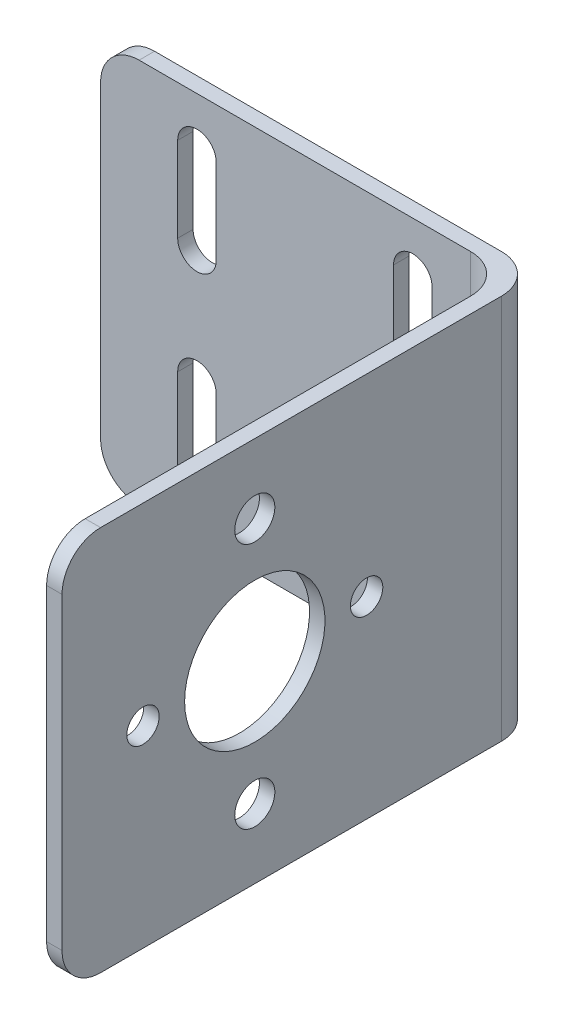
ISO-10303-21;
HEADER;
FILE_DESCRIPTION(('STEP AP214'),'2;1');
FILE_NAME('part.step','',(''),(''),'','','');
FILE_SCHEMA(('AUTOMOTIVE_DESIGN { 1 0 10303 214 1 1 1 1 }'));
ENDSEC;
DATA;
#1=APPLICATION_CONTEXT('core data for automotive mechanical design processes');
#2=APPLICATION_PROTOCOL_DEFINITION('international standard','automotive_design',2000,#1);
#3=PRODUCT_CONTEXT('',#1,'mechanical');
#4=PRODUCT('Part','Part','',(#3));
#5=PRODUCT_RELATED_PRODUCT_CATEGORY('part','',(#4));
#6=PRODUCT_DEFINITION_FORMATION('','',#4);
#7=PRODUCT_DEFINITION_CONTEXT('part definition',#1,'design');
#8=PRODUCT_DEFINITION('design','',#6,#7);
#9=PRODUCT_DEFINITION_SHAPE('','',#8);
#10=(LENGTH_UNIT() NAMED_UNIT(*) SI_UNIT(.MILLI.,.METRE.));
#11=(NAMED_UNIT(*) PLANE_ANGLE_UNIT() SI_UNIT($,.RADIAN.));
#12=(NAMED_UNIT(*) SI_UNIT($,.STERADIAN.) SOLID_ANGLE_UNIT());
#13=UNCERTAINTY_MEASURE_WITH_UNIT(LENGTH_MEASURE(1.E-05),#10,'distance_accuracy_value','');
#14=(GEOMETRIC_REPRESENTATION_CONTEXT(3) GLOBAL_UNCERTAINTY_ASSIGNED_CONTEXT((#13)) GLOBAL_UNIT_ASSIGNED_CONTEXT((#10,
#11,#12)) REPRESENTATION_CONTEXT('',''));
#15=CARTESIAN_POINT('',(0.,0.,0.));
#16=DIRECTION('',(0.,0.,1.));
#17=DIRECTION('',(1.,0.,0.));
#18=AXIS2_PLACEMENT_3D('',#15,#16,#17);
#19=CARTESIAN_POINT('',(-26.5,25.,2.));
#20=DIRECTION('',(0.,-1.,0.));
#21=DIRECTION('',(1.,0.,0.));
#22=AXIS2_PLACEMENT_3D('',#19,#20,#21);
#23=PLANE('',#22);
#24=DIRECTION('',(-1.,0.,0.));
#25=VECTOR('',#24,1.);
#26=CARTESIAN_POINT('',(-26.5,25.,0.));
#27=LINE('',#26,#25);
#28=CARTESIAN_POINT('',(23.5,25.,0.));
#29=VERTEX_POINT('',#28);
#30=CARTESIAN_POINT('',(-21.5,25.,0.));
#31=VERTEX_POINT('',#30);
#32=EDGE_CURVE('E391',#29,#31,#27,.T.);
#33=ORIENTED_EDGE('',*,*,#32,.T.);
#34=DIRECTION('',(0.,0.,-1.));
#35=VECTOR('',#34,1.);
#36=CARTESIAN_POINT('',(-21.5,25.,2.));
#37=LINE('',#36,#35);
#38=CARTESIAN_POINT('',(-21.5,25.,2.));
#39=VERTEX_POINT('',#38);
#40=EDGE_CURVE('E438',#31,#39,#37,.F.);
#41=ORIENTED_EDGE('',*,*,#40,.T.);
#42=DIRECTION('',(-1.,0.,0.));
#43=VECTOR('',#42,1.);
#44=CARTESIAN_POINT('',(-26.5,25.,2.));
#45=LINE('',#44,#43);
#46=CARTESIAN_POINT('',(21.5,25.,2.));
#47=VERTEX_POINT('',#46);
#48=EDGE_CURVE('E392',#47,#39,#45,.T.);
#49=ORIENTED_EDGE('',*,*,#48,.F.);
#50=CARTESIAN_POINT('',(21.5,25.,7.));
#51=DIRECTION('',(0.,-1.,0.));
#52=DIRECTION('',(1.,0.,0.));
#53=AXIS2_PLACEMENT_3D('',#50,#51,#52);
#54=CIRCLE('',#53,5.);
#55=CARTESIAN_POINT('',(26.5,25.,7.));
#56=VERTEX_POINT('',#55);
#57=EDGE_CURVE('E47',#47,#56,#54,.T.);
#58=ORIENTED_EDGE('',*,*,#57,.T.);
#59=DIRECTION('',(0.,0.,-1.));
#60=VECTOR('',#59,1.);
#61=CARTESIAN_POINT('',(26.5,25.,62.));
#62=LINE('',#61,#60);
#63=CARTESIAN_POINT('',(26.5,25.,57.));
#64=VERTEX_POINT('',#63);
#65=EDGE_CURVE('E382',#64,#56,#62,.T.);
#66=ORIENTED_EDGE('',*,*,#65,.F.);
#67=DIRECTION('',(-1.,0.,0.));
#68=VECTOR('',#67,1.);
#69=CARTESIAN_POINT('',(28.5,25.,57.));
#70=LINE('',#69,#68);
#71=CARTESIAN_POINT('',(28.5,25.,57.));
#72=VERTEX_POINT('',#71);
#73=EDGE_CURVE('E434',#64,#72,#70,.F.);
#74=ORIENTED_EDGE('',*,*,#73,.T.);
#75=DIRECTION('',(0.,0.,-1.));
#76=VECTOR('',#75,1.);
#77=CARTESIAN_POINT('',(28.5,25.,62.));
#78=LINE('',#77,#76);
#79=CARTESIAN_POINT('',(28.5,25.,5.));
#80=VERTEX_POINT('',#79);
#81=EDGE_CURVE('E385',#72,#80,#78,.T.);
#82=ORIENTED_EDGE('',*,*,#81,.T.);
#83=CARTESIAN_POINT('',(23.5,25.,5.));
#84=DIRECTION('',(0.,-1.,0.));
#85=DIRECTION('',(1.,0.,0.));
#86=AXIS2_PLACEMENT_3D('',#83,#84,#85);
#87=CIRCLE('',#86,5.);
#88=EDGE_CURVE('E436',#80,#29,#87,.F.);
#89=ORIENTED_EDGE('',*,*,#88,.T.);
#90=EDGE_LOOP('',(#33,#41,#49,#58,#66,#74,#82,#89));
#91=FACE_BOUND('',#90,.T.);
#92=ADVANCED_FACE('F39',(#91),#23,.F.);
#93=CARTESIAN_POINT('',(-26.5,-25.,2.));
#94=DIRECTION('',(1.,0.,0.));
#95=DIRECTION('',(0.,0.,-1.));
#96=AXIS2_PLACEMENT_3D('',#93,#94,#95);
#97=PLANE('',#96);
#98=DIRECTION('',(0.,-1.,0.));
#99=VECTOR('',#98,1.);
#100=CARTESIAN_POINT('',(-26.5,-25.,0.));
#101=LINE('',#100,#99);
#102=CARTESIAN_POINT('',(-26.5,20.,0.));
#103=VERTEX_POINT('',#102);
#104=CARTESIAN_POINT('',(-26.5,-20.,0.));
#105=VERTEX_POINT('',#104);
#106=EDGE_CURVE('E405',#103,#105,#101,.T.);
#107=ORIENTED_EDGE('',*,*,#106,.T.);
#108=DIRECTION('',(0.,0.,-1.));
#109=VECTOR('',#108,1.);
#110=CARTESIAN_POINT('',(-26.5,-20.,2.));
#111=LINE('',#110,#109);
#112=CARTESIAN_POINT('',(-26.5,-20.,2.));
#113=VERTEX_POINT('',#112);
#114=EDGE_CURVE('E425',#105,#113,#111,.F.);
#115=ORIENTED_EDGE('',*,*,#114,.T.);
#116=DIRECTION('',(0.,-1.,0.));
#117=VECTOR('',#116,1.);
#118=CARTESIAN_POINT('',(-26.5,-25.,2.));
#119=LINE('',#118,#117);
#120=CARTESIAN_POINT('',(-26.5,20.,2.));
#121=VERTEX_POINT('',#120);
#122=EDGE_CURVE('E395',#121,#113,#119,.T.);
#123=ORIENTED_EDGE('',*,*,#122,.F.);
#124=DIRECTION('',(0.,0.,-1.));
#125=VECTOR('',#124,1.);
#126=CARTESIAN_POINT('',(-26.5,20.,2.));
#127=LINE('',#126,#125);
#128=EDGE_CURVE('E422',#121,#103,#127,.T.);
#129=ORIENTED_EDGE('',*,*,#128,.T.);
#130=EDGE_LOOP('',(#107,#115,#123,#129));
#131=FACE_BOUND('',#130,.T.);
#132=ADVANCED_FACE('F500',(#131),#97,.F.);
#133=CARTESIAN_POINT('',(-26.5,-25.,2.));
#134=DIRECTION('',(0.,1.,0.));
#135=DIRECTION('',(-1.,0.,0.));
#136=AXIS2_PLACEMENT_3D('',#133,#134,#135);
#137=PLANE('',#136);
#138=DIRECTION('',(1.,0.,0.));
#139=VECTOR('',#138,1.);
#140=CARTESIAN_POINT('',(-26.5,-25.,2.));
#141=LINE('',#140,#139);
#142=CARTESIAN_POINT('',(-21.5,-25.,2.));
#143=VERTEX_POINT('',#142);
#144=CARTESIAN_POINT('',(21.5,-25.,2.));
#145=VERTEX_POINT('',#144);
#146=EDGE_CURVE('E399',#143,#145,#141,.T.);
#147=ORIENTED_EDGE('',*,*,#146,.F.);
#148=DIRECTION('',(0.,0.,-1.));
#149=VECTOR('',#148,1.);
#150=CARTESIAN_POINT('',(-21.5,-25.,2.));
#151=LINE('',#150,#149);
#152=CARTESIAN_POINT('',(-21.5,-25.,0.));
#153=VERTEX_POINT('',#152);
#154=EDGE_CURVE('E413',#143,#153,#151,.T.);
#155=ORIENTED_EDGE('',*,*,#154,.T.);
#156=DIRECTION('',(1.,0.,0.));
#157=VECTOR('',#156,1.);
#158=CARTESIAN_POINT('',(-26.5,-25.,0.));
#159=LINE('',#158,#157);
#160=CARTESIAN_POINT('',(23.5,-25.,0.));
#161=VERTEX_POINT('',#160);
#162=EDGE_CURVE('E396',#153,#161,#159,.T.);
#163=ORIENTED_EDGE('',*,*,#162,.T.);
#164=CARTESIAN_POINT('',(23.5,-25.,5.));
#165=DIRECTION('',(0.,1.,0.));
#166=DIRECTION('',(-1.,0.,0.));
#167=AXIS2_PLACEMENT_3D('',#164,#165,#166);
#168=CIRCLE('',#167,5.);
#169=CARTESIAN_POINT('',(28.5,-25.,5.));
#170=VERTEX_POINT('',#169);
#171=EDGE_CURVE('E411',#161,#170,#168,.F.);
#172=ORIENTED_EDGE('',*,*,#171,.T.);
#173=DIRECTION('',(0.,0.,-1.));
#174=VECTOR('',#173,1.);
#175=CARTESIAN_POINT('',(28.5,-25.,62.));
#176=LINE('',#175,#174);
#177=CARTESIAN_POINT('',(28.5,-25.,57.));
#178=VERTEX_POINT('',#177);
#179=EDGE_CURVE('E388',#178,#170,#176,.T.);
#180=ORIENTED_EDGE('',*,*,#179,.F.);
#181=DIRECTION('',(1.,0.,0.));
#182=VECTOR('',#181,1.);
#183=CARTESIAN_POINT('',(26.5,-25.,57.));
#184=LINE('',#183,#182);
#185=CARTESIAN_POINT('',(26.5,-25.,57.));
#186=VERTEX_POINT('',#185);
#187=EDGE_CURVE('E402',#178,#186,#184,.F.);
#188=ORIENTED_EDGE('',*,*,#187,.T.);
#189=DIRECTION('',(0.,0.,-1.));
#190=VECTOR('',#189,1.);
#191=CARTESIAN_POINT('',(26.5,-25.,62.));
#192=LINE('',#191,#190);
#193=CARTESIAN_POINT('',(26.5,-25.,7.));
#194=VERTEX_POINT('',#193);
#195=EDGE_CURVE('E379',#186,#194,#192,.T.);
#196=ORIENTED_EDGE('',*,*,#195,.T.);
#197=CARTESIAN_POINT('',(21.5,-25.,7.));
#198=DIRECTION('',(0.,1.,0.));
#199=DIRECTION('',(-1.,0.,0.));
#200=AXIS2_PLACEMENT_3D('',#197,#198,#199);
#201=CIRCLE('',#200,5.);
#202=EDGE_CURVE('E11',#194,#145,#201,.T.);
#203=ORIENTED_EDGE('',*,*,#202,.T.);
#204=EDGE_LOOP('',(#147,#155,#163,#172,#180,#188,#196,#203));
#205=FACE_BOUND('',#204,.T.);
#206=ADVANCED_FACE('F470',(#205),#137,.F.);
#207=CARTESIAN_POINT('',(0.,0.,2.));
#208=DIRECTION('',(0.,0.,1.));
#209=DIRECTION('',(1.,0.,0.));
#210=AXIS2_PLACEMENT_3D('',#207,#208,#209);
#211=PLANE('',#210);
#212=CARTESIAN_POINT('',(-14.,-7.50000000000001,2.));
#213=DIRECTION('',(0.,0.,1.));
#214=DIRECTION('',(1.,0.,0.));
#215=AXIS2_PLACEMENT_3D('',#212,#213,#214);
#216=CIRCLE('',#215,2.5);
#217=CARTESIAN_POINT('',(-11.5,-7.50000000000001,2.));
#218=VERTEX_POINT('',#217);
#219=CARTESIAN_POINT('',(-16.5,-7.50000000000001,2.));
#220=VERTEX_POINT('',#219);
#221=EDGE_CURVE('E279',#218,#220,#216,.T.);
#222=ORIENTED_EDGE('',*,*,#221,.F.);
#223=DIRECTION('',(0.,1.,0.));
#224=VECTOR('',#223,1.);
#225=CARTESIAN_POINT('',(-11.5,-7.50000000000001,2.));
#226=LINE('',#225,#224);
#227=CARTESIAN_POINT('',(-11.5,-18.5,2.));
#228=VERTEX_POINT('',#227);
#229=EDGE_CURVE('E263',#228,#218,#226,.T.);
#230=ORIENTED_EDGE('',*,*,#229,.F.);
#231=CARTESIAN_POINT('',(-14.,-18.5,2.));
#232=DIRECTION('',(0.,0.,1.));
#233=DIRECTION('',(1.,0.,0.));
#234=AXIS2_PLACEMENT_3D('',#231,#232,#233);
#235=CIRCLE('',#234,2.5);
#236=CARTESIAN_POINT('',(-16.5,-18.5,2.));
#237=VERTEX_POINT('',#236);
#238=EDGE_CURVE('E273',#237,#228,#235,.T.);
#239=ORIENTED_EDGE('',*,*,#238,.F.);
#240=DIRECTION('',(0.,-1.,0.));
#241=VECTOR('',#240,1.);
#242=CARTESIAN_POINT('',(-16.5,-7.50000000000001,2.));
#243=LINE('',#242,#241);
#244=EDGE_CURVE('E276',#220,#237,#243,.T.);
#245=ORIENTED_EDGE('',*,*,#244,.F.);
#246=EDGE_LOOP('',(#222,#230,#239,#245));
#247=FACE_BOUND('',#246,.T.);
#248=CARTESIAN_POINT('',(14.,18.5,2.));
#249=DIRECTION('',(0.,0.,1.));
#250=DIRECTION('',(1.,0.,0.));
#251=AXIS2_PLACEMENT_3D('',#248,#249,#250);
#252=CIRCLE('',#251,2.5);
#253=CARTESIAN_POINT('',(16.5,18.5,2.));
#254=VERTEX_POINT('',#253);
#255=CARTESIAN_POINT('',(11.5,18.5,2.));
#256=VERTEX_POINT('',#255);
#257=EDGE_CURVE('E259',#254,#256,#252,.T.);
#258=ORIENTED_EDGE('',*,*,#257,.F.);
#259=DIRECTION('',(0.,1.,0.));
#260=VECTOR('',#259,1.);
#261=CARTESIAN_POINT('',(16.5,18.5,2.));
#262=LINE('',#261,#260);
#263=CARTESIAN_POINT('',(16.5,7.49999999999999,2.));
#264=VERTEX_POINT('',#263);
#265=EDGE_CURVE('E294',#264,#254,#262,.T.);
#266=ORIENTED_EDGE('',*,*,#265,.F.);
#267=CARTESIAN_POINT('',(14.,7.49999999999999,2.));
#268=DIRECTION('',(0.,0.,1.));
#269=DIRECTION('',(1.,0.,0.));
#270=AXIS2_PLACEMENT_3D('',#267,#268,#269);
#271=CIRCLE('',#270,2.5);
#272=CARTESIAN_POINT('',(11.5,7.49999999999999,2.));
#273=VERTEX_POINT('',#272);
#274=EDGE_CURVE('E304',#273,#264,#271,.T.);
#275=ORIENTED_EDGE('',*,*,#274,.F.);
#276=DIRECTION('',(0.,-1.,0.));
#277=VECTOR('',#276,1.);
#278=CARTESIAN_POINT('',(11.5,18.5,2.));
#279=LINE('',#278,#277);
#280=EDGE_CURVE('E307',#256,#273,#279,.T.);
#281=ORIENTED_EDGE('',*,*,#280,.F.);
#282=EDGE_LOOP('',(#258,#266,#275,#281));
#283=FACE_BOUND('',#282,.T.);
#284=CARTESIAN_POINT('',(14.,-7.50000000000001,2.));
#285=DIRECTION('',(0.,0.,1.));
#286=DIRECTION('',(1.,0.,0.));
#287=AXIS2_PLACEMENT_3D('',#284,#285,#286);
#288=CIRCLE('',#287,2.5);
#289=CARTESIAN_POINT('',(16.5,-7.50000000000001,2.));
#290=VERTEX_POINT('',#289);
#291=CARTESIAN_POINT('',(11.5,-7.50000000000001,2.));
#292=VERTEX_POINT('',#291);
#293=EDGE_CURVE('E290',#290,#292,#288,.T.);
#294=ORIENTED_EDGE('',*,*,#293,.F.);
#295=DIRECTION('',(0.,1.,0.));
#296=VECTOR('',#295,1.);
#297=CARTESIAN_POINT('',(16.5,-7.50000000000001,2.));
#298=LINE('',#297,#296);
#299=CARTESIAN_POINT('',(16.5,-18.5,2.));
#300=VERTEX_POINT('',#299);
#301=EDGE_CURVE('E243',#300,#290,#298,.T.);
#302=ORIENTED_EDGE('',*,*,#301,.F.);
#303=CARTESIAN_POINT('',(14.,-18.5,2.));
#304=DIRECTION('',(0.,0.,1.));
#305=DIRECTION('',(1.,0.,0.));
#306=AXIS2_PLACEMENT_3D('',#303,#304,#305);
#307=CIRCLE('',#306,2.5);
#308=CARTESIAN_POINT('',(11.5,-18.5,2.));
#309=VERTEX_POINT('',#308);
#310=EDGE_CURVE('E856',#309,#300,#307,.T.);
#311=ORIENTED_EDGE('',*,*,#310,.F.);
#312=DIRECTION('',(0.,-1.,0.));
#313=VECTOR('',#312,1.);
#314=CARTESIAN_POINT('',(11.5,-7.50000000000001,2.));
#315=LINE('',#314,#313);
#316=EDGE_CURVE('E855',#292,#309,#315,.T.);
#317=ORIENTED_EDGE('',*,*,#316,.F.);
#318=EDGE_LOOP('',(#294,#302,#311,#317));
#319=FACE_BOUND('',#318,.T.);
#320=CARTESIAN_POINT('',(-14.,18.5,2.));
#321=DIRECTION('',(0.,0.,1.));
#322=DIRECTION('',(1.,0.,0.));
#323=AXIS2_PLACEMENT_3D('',#320,#321,#322);
#324=CIRCLE('',#323,2.5);
#325=CARTESIAN_POINT('',(-11.5,18.5,2.));
#326=VERTEX_POINT('',#325);
#327=CARTESIAN_POINT('',(-16.5,18.5,2.));
#328=VERTEX_POINT('',#327);
#329=EDGE_CURVE('E281',#326,#328,#324,.T.);
#330=ORIENTED_EDGE('',*,*,#329,.F.);
#331=DIRECTION('',(0.,1.,0.));
#332=VECTOR('',#331,1.);
#333=CARTESIAN_POINT('',(-11.5,18.5,2.));
#334=LINE('',#333,#332);
#335=CARTESIAN_POINT('',(-11.5,7.5,2.));
#336=VERTEX_POINT('',#335);
#337=EDGE_CURVE('E332',#336,#326,#334,.T.);
#338=ORIENTED_EDGE('',*,*,#337,.F.);
#339=CARTESIAN_POINT('',(-14.,7.5,2.));
#340=DIRECTION('',(0.,0.,1.));
#341=DIRECTION('',(1.,0.,0.));
#342=AXIS2_PLACEMENT_3D('',#339,#340,#341);
#343=CIRCLE('',#342,2.5);
#344=CARTESIAN_POINT('',(-16.5,7.5,2.));
#345=VERTEX_POINT('',#344);
#346=EDGE_CURVE('E329',#345,#336,#343,.T.);
#347=ORIENTED_EDGE('',*,*,#346,.F.);
#348=DIRECTION('',(0.,-1.,0.));
#349=VECTOR('',#348,1.);
#350=CARTESIAN_POINT('',(-16.5,18.5,2.));
#351=LINE('',#350,#349);
#352=EDGE_CURVE('E326',#328,#345,#351,.T.);
#353=ORIENTED_EDGE('',*,*,#352,.F.);
#354=EDGE_LOOP('',(#330,#338,#347,#353));
#355=FACE_BOUND('',#354,.T.);
#356=ORIENTED_EDGE('',*,*,#122,.T.);
#357=CARTESIAN_POINT('',(-21.5,-20.,2.));
#358=DIRECTION('',(0.,0.,1.));
#359=DIRECTION('',(1.,0.,0.));
#360=AXIS2_PLACEMENT_3D('',#357,#358,#359);
#361=CIRCLE('',#360,5.);
#362=EDGE_CURVE('E432',#113,#143,#361,.T.);
#363=ORIENTED_EDGE('',*,*,#362,.T.);
#364=ORIENTED_EDGE('',*,*,#146,.T.);
#365=DIRECTION('',(0.,1.,0.));
#366=VECTOR('',#365,1.);
#367=CARTESIAN_POINT('',(21.5,0.,2.));
#368=LINE('',#367,#366);
#369=EDGE_CURVE('E427',#145,#47,#368,.T.);
#370=ORIENTED_EDGE('',*,*,#369,.T.);
#371=ORIENTED_EDGE('',*,*,#48,.T.);
#372=CARTESIAN_POINT('',(-21.5,20.,2.));
#373=DIRECTION('',(0.,0.,1.));
#374=DIRECTION('',(1.,0.,0.));
#375=AXIS2_PLACEMENT_3D('',#372,#373,#374);
#376=CIRCLE('',#375,5.);
#377=EDGE_CURVE('E430',#39,#121,#376,.T.);
#378=ORIENTED_EDGE('',*,*,#377,.T.);
#379=EDGE_LOOP('',(#356,#363,#364,#370,#371,#378));
#380=FACE_BOUND('',#379,.T.);
#381=ADVANCED_FACE('F473',(#247,#283,#319,#355,#380),#211,.T.);
#382=CARTESIAN_POINT('',(0.,0.,0.));
#383=DIRECTION('',(0.,0.,1.));
#384=DIRECTION('',(1.,0.,0.));
#385=AXIS2_PLACEMENT_3D('',#382,#383,#384);
#386=PLANE('',#385);
#387=DIRECTION('',(0.,-1.,0.));
#388=VECTOR('',#387,1.);
#389=CARTESIAN_POINT('',(-11.5,-7.50000000000001,0.));
#390=LINE('',#389,#388);
#391=CARTESIAN_POINT('',(-11.5,-7.50000000000001,0.));
#392=VERTEX_POINT('',#391);
#393=CARTESIAN_POINT('',(-11.5,-18.5,0.));
#394=VERTEX_POINT('',#393);
#395=EDGE_CURVE('E283',#392,#394,#390,.T.);
#396=ORIENTED_EDGE('',*,*,#395,.F.);
#397=CARTESIAN_POINT('',(-14.,-7.50000000000001,0.));
#398=DIRECTION('',(0.,0.,1.));
#399=DIRECTION('',(1.,0.,0.));
#400=AXIS2_PLACEMENT_3D('',#397,#398,#399);
#401=CIRCLE('',#400,2.5);
#402=CARTESIAN_POINT('',(-16.5,-7.50000000000001,0.));
#403=VERTEX_POINT('',#402);
#404=EDGE_CURVE('E258',#403,#392,#401,.F.);
#405=ORIENTED_EDGE('',*,*,#404,.F.);
#406=DIRECTION('',(0.,1.,0.));
#407=VECTOR('',#406,1.);
#408=CARTESIAN_POINT('',(-16.5,-7.50000000000001,0.));
#409=LINE('',#408,#407);
#410=CARTESIAN_POINT('',(-16.5,-18.5,0.));
#411=VERTEX_POINT('',#410);
#412=EDGE_CURVE('E256',#411,#403,#409,.T.);
#413=ORIENTED_EDGE('',*,*,#412,.F.);
#414=CARTESIAN_POINT('',(-14.,-18.5,0.));
#415=DIRECTION('',(0.,0.,1.));
#416=DIRECTION('',(1.,0.,0.));
#417=AXIS2_PLACEMENT_3D('',#414,#415,#416);
#418=CIRCLE('',#417,2.5);
#419=EDGE_CURVE('E270',#394,#411,#418,.F.);
#420=ORIENTED_EDGE('',*,*,#419,.F.);
#421=EDGE_LOOP('',(#396,#405,#413,#420));
#422=FACE_BOUND('',#421,.T.);
#423=DIRECTION('',(0.,-1.,0.));
#424=VECTOR('',#423,1.);
#425=CARTESIAN_POINT('',(16.5,18.5,0.));
#426=LINE('',#425,#424);
#427=CARTESIAN_POINT('',(16.5,18.5,0.));
#428=VERTEX_POINT('',#427);
#429=CARTESIAN_POINT('',(16.5,7.49999999999999,0.));
#430=VERTEX_POINT('',#429);
#431=EDGE_CURVE('E312',#428,#430,#426,.T.);
#432=ORIENTED_EDGE('',*,*,#431,.F.);
#433=CARTESIAN_POINT('',(14.,18.5,0.));
#434=DIRECTION('',(0.,0.,1.));
#435=DIRECTION('',(1.,0.,0.));
#436=AXIS2_PLACEMENT_3D('',#433,#434,#435);
#437=CIRCLE('',#436,2.5);
#438=CARTESIAN_POINT('',(11.5,18.5,0.));
#439=VERTEX_POINT('',#438);
#440=EDGE_CURVE('E289',#439,#428,#437,.F.);
#441=ORIENTED_EDGE('',*,*,#440,.F.);
#442=DIRECTION('',(0.,1.,0.));
#443=VECTOR('',#442,1.);
#444=CARTESIAN_POINT('',(11.5,18.5,0.));
#445=LINE('',#444,#443);
#446=CARTESIAN_POINT('',(11.5,7.49999999999999,0.));
#447=VERTEX_POINT('',#446);
#448=EDGE_CURVE('E287',#447,#439,#445,.T.);
#449=ORIENTED_EDGE('',*,*,#448,.F.);
#450=CARTESIAN_POINT('',(14.,7.49999999999999,0.));
#451=DIRECTION('',(0.,0.,1.));
#452=DIRECTION('',(1.,0.,0.));
#453=AXIS2_PLACEMENT_3D('',#450,#451,#452);
#454=CIRCLE('',#453,2.5);
#455=EDGE_CURVE('E301',#430,#447,#454,.F.);
#456=ORIENTED_EDGE('',*,*,#455,.F.);
#457=EDGE_LOOP('',(#432,#441,#449,#456));
#458=FACE_BOUND('',#457,.T.);
#459=DIRECTION('',(0.,-1.,0.));
#460=VECTOR('',#459,1.);
#461=CARTESIAN_POINT('',(16.5,-7.50000000000001,0.));
#462=LINE('',#461,#460);
#463=CARTESIAN_POINT('',(16.5,-7.50000000000001,0.));
#464=VERTEX_POINT('',#463);
#465=CARTESIAN_POINT('',(16.5,-18.5,0.));
#466=VERTEX_POINT('',#465);
#467=EDGE_CURVE('E236',#464,#466,#462,.T.);
#468=ORIENTED_EDGE('',*,*,#467,.F.);
#469=CARTESIAN_POINT('',(14.,-7.50000000000001,0.));
#470=DIRECTION('',(0.,0.,1.));
#471=DIRECTION('',(1.,0.,0.));
#472=AXIS2_PLACEMENT_3D('',#469,#470,#471);
#473=CIRCLE('',#472,2.5);
#474=CARTESIAN_POINT('',(11.5,-7.50000000000001,0.));
#475=VERTEX_POINT('',#474);
#476=EDGE_CURVE('E226',#475,#464,#473,.F.);
#477=ORIENTED_EDGE('',*,*,#476,.F.);
#478=DIRECTION('',(0.,1.,0.));
#479=VECTOR('',#478,1.);
#480=CARTESIAN_POINT('',(11.5,-7.50000000000001,0.));
#481=LINE('',#480,#479);
#482=CARTESIAN_POINT('',(11.5,-18.5,0.));
#483=VERTEX_POINT('',#482);
#484=EDGE_CURVE('E237',#483,#475,#481,.T.);
#485=ORIENTED_EDGE('',*,*,#484,.F.);
#486=CARTESIAN_POINT('',(14.,-18.5,0.));
#487=DIRECTION('',(0.,0.,1.));
#488=DIRECTION('',(1.,0.,0.));
#489=AXIS2_PLACEMENT_3D('',#486,#487,#488);
#490=CIRCLE('',#489,2.5);
#491=EDGE_CURVE('E246',#466,#483,#490,.F.);
#492=ORIENTED_EDGE('',*,*,#491,.F.);
#493=EDGE_LOOP('',(#468,#477,#485,#492));
#494=FACE_BOUND('',#493,.T.);
#495=DIRECTION('',(0.,-1.,0.));
#496=VECTOR('',#495,1.);
#497=CARTESIAN_POINT('',(-11.5,18.5,0.));
#498=LINE('',#497,#496);
#499=CARTESIAN_POINT('',(-11.5,18.5,0.));
#500=VERTEX_POINT('',#499);
#501=CARTESIAN_POINT('',(-11.5,7.5,0.));
#502=VERTEX_POINT('',#501);
#503=EDGE_CURVE('E319',#500,#502,#498,.T.);
#504=ORIENTED_EDGE('',*,*,#503,.F.);
#505=CARTESIAN_POINT('',(-14.,18.5,0.));
#506=DIRECTION('',(0.,0.,1.));
#507=DIRECTION('',(1.,0.,0.));
#508=AXIS2_PLACEMENT_3D('',#505,#506,#507);
#509=CIRCLE('',#508,2.5);
#510=CARTESIAN_POINT('',(-16.5,18.5,0.));
#511=VERTEX_POINT('',#510);
#512=EDGE_CURVE('E322',#511,#500,#509,.F.);
#513=ORIENTED_EDGE('',*,*,#512,.F.);
#514=DIRECTION('',(0.,1.,0.));
#515=VECTOR('',#514,1.);
#516=CARTESIAN_POINT('',(-16.5,18.5,0.));
#517=LINE('',#516,#515);
#518=CARTESIAN_POINT('',(-16.5,7.5,0.));
#519=VERTEX_POINT('',#518);
#520=EDGE_CURVE('E324',#519,#511,#517,.T.);
#521=ORIENTED_EDGE('',*,*,#520,.F.);
#522=CARTESIAN_POINT('',(-14.,7.5,0.));
#523=DIRECTION('',(0.,0.,1.));
#524=DIRECTION('',(1.,0.,0.));
#525=AXIS2_PLACEMENT_3D('',#522,#523,#524);
#526=CIRCLE('',#525,2.5);
#527=EDGE_CURVE('E316',#502,#519,#526,.F.);
#528=ORIENTED_EDGE('',*,*,#527,.F.);
#529=EDGE_LOOP('',(#504,#513,#521,#528));
#530=FACE_BOUND('',#529,.T.);
#531=ORIENTED_EDGE('',*,*,#162,.F.);
#532=CARTESIAN_POINT('',(-21.5,-20.,0.));
#533=DIRECTION('',(0.,0.,1.));
#534=DIRECTION('',(1.,0.,0.));
#535=AXIS2_PLACEMENT_3D('',#532,#533,#534);
#536=CIRCLE('',#535,5.);
#537=EDGE_CURVE('E420',#153,#105,#536,.F.);
#538=ORIENTED_EDGE('',*,*,#537,.T.);
#539=ORIENTED_EDGE('',*,*,#106,.F.);
#540=CARTESIAN_POINT('',(-21.5,20.,0.));
#541=DIRECTION('',(0.,0.,1.));
#542=DIRECTION('',(1.,0.,0.));
#543=AXIS2_PLACEMENT_3D('',#540,#541,#542);
#544=CIRCLE('',#543,5.);
#545=EDGE_CURVE('E418',#103,#31,#544,.F.);
#546=ORIENTED_EDGE('',*,*,#545,.T.);
#547=ORIENTED_EDGE('',*,*,#32,.F.);
#548=DIRECTION('',(0.,1.,0.));
#549=VECTOR('',#548,1.);
#550=CARTESIAN_POINT('',(23.5,0.,0.));
#551=LINE('',#550,#549);
#552=EDGE_CURVE('E416',#29,#161,#551,.F.);
#553=ORIENTED_EDGE('',*,*,#552,.T.);
#554=EDGE_LOOP('',(#531,#538,#539,#546,#547,#553));
#555=FACE_BOUND('',#554,.T.);
#556=ADVANCED_FACE('F249',(#422,#458,#494,#530,#555),#386,.F.);
#557=CARTESIAN_POINT('',(28.5,-25.,62.));
#558=DIRECTION('',(-1.,0.,0.));
#559=DIRECTION('',(0.,0.,1.));
#560=AXIS2_PLACEMENT_3D('',#557,#558,#559);
#561=PLANE('',#560);
#562=CARTESIAN_POINT('',(28.5,-16.,37.));
#563=DIRECTION('',(-1.,0.,0.));
#564=DIRECTION('',(0.,0.,1.));
#565=AXIS2_PLACEMENT_3D('',#562,#563,#564);
#566=CIRCLE('',#565,2.6);
#567=CARTESIAN_POINT('',(28.5,-16.,39.6));
#568=VERTEX_POINT('',#567);
#569=EDGE_CURVE('E357',#568,#568,#566,.F.);
#570=ORIENTED_EDGE('',*,*,#569,.F.);
#571=EDGE_LOOP('',(#570));
#572=FACE_BOUND('',#571,.T.);
#573=CARTESIAN_POINT('',(28.5,16.,37.));
#574=DIRECTION('',(-1.,0.,0.));
#575=DIRECTION('',(0.,0.,1.));
#576=AXIS2_PLACEMENT_3D('',#573,#574,#575);
#577=CIRCLE('',#576,2.6);
#578=CARTESIAN_POINT('',(28.5,16.,39.6));
#579=VERTEX_POINT('',#578);
#580=EDGE_CURVE('E352',#579,#579,#577,.F.);
#581=ORIENTED_EDGE('',*,*,#580,.F.);
#582=EDGE_LOOP('',(#581));
#583=FACE_BOUND('',#582,.T.);
#584=CARTESIAN_POINT('',(28.5,0.,51.5));
#585=DIRECTION('',(-1.,0.,0.));
#586=DIRECTION('',(0.,0.,1.));
#587=AXIS2_PLACEMENT_3D('',#584,#585,#586);
#588=CIRCLE('',#587,2.1);
#589=CARTESIAN_POINT('',(28.5,0.,53.6));
#590=VERTEX_POINT('',#589);
#591=EDGE_CURVE('E345',#590,#590,#588,.F.);
#592=ORIENTED_EDGE('',*,*,#591,.F.);
#593=EDGE_LOOP('',(#592));
#594=FACE_BOUND('',#593,.T.);
#595=CARTESIAN_POINT('',(28.5,0.,22.5));
#596=DIRECTION('',(-1.,0.,0.));
#597=DIRECTION('',(0.,0.,1.));
#598=AXIS2_PLACEMENT_3D('',#595,#596,#597);
#599=CIRCLE('',#598,2.1);
#600=CARTESIAN_POINT('',(28.5,0.,24.6));
#601=VERTEX_POINT('',#600);
#602=EDGE_CURVE('E344',#601,#601,#599,.F.);
#603=ORIENTED_EDGE('',*,*,#602,.F.);
#604=EDGE_LOOP('',(#603));
#605=FACE_BOUND('',#604,.T.);
#606=CARTESIAN_POINT('',(28.5,0.,37.));
#607=DIRECTION('',(-1.,0.,0.));
#608=DIRECTION('',(0.,0.,1.));
#609=AXIS2_PLACEMENT_3D('',#606,#607,#608);
#610=CIRCLE('',#609,9.1);
#611=CARTESIAN_POINT('',(28.5,0.,46.1));
#612=VERTEX_POINT('',#611);
#613=EDGE_CURVE('E371',#612,#612,#610,.F.);
#614=ORIENTED_EDGE('',*,*,#613,.F.);
#615=EDGE_LOOP('',(#614));
#616=FACE_BOUND('',#615,.T.);
#617=ORIENTED_EDGE('',*,*,#179,.T.);
#618=DIRECTION('',(0.,1.,0.));
#619=VECTOR('',#618,1.);
#620=CARTESIAN_POINT('',(28.5,-25.,5.));
#621=LINE('',#620,#619);
#622=EDGE_CURVE('E448',#170,#80,#621,.T.);
#623=ORIENTED_EDGE('',*,*,#622,.T.);
#624=ORIENTED_EDGE('',*,*,#81,.F.);
#625=CARTESIAN_POINT('',(28.5,20.,57.));
#626=DIRECTION('',(-1.,0.,0.));
#627=DIRECTION('',(0.,0.,1.));
#628=AXIS2_PLACEMENT_3D('',#625,#626,#627);
#629=CIRCLE('',#628,5.);
#630=CARTESIAN_POINT('',(28.5,20.,62.));
#631=VERTEX_POINT('',#630);
#632=EDGE_CURVE('E54',#72,#631,#629,.F.);
#633=ORIENTED_EDGE('',*,*,#632,.T.);
#634=DIRECTION('',(0.,1.,0.));
#635=VECTOR('',#634,1.);
#636=CARTESIAN_POINT('',(28.5,-25.,62.));
#637=LINE('',#636,#635);
#638=CARTESIAN_POINT('',(28.5,-20.,62.));
#639=VERTEX_POINT('',#638);
#640=EDGE_CURVE('E374',#639,#631,#637,.T.);
#641=ORIENTED_EDGE('',*,*,#640,.F.);
#642=CARTESIAN_POINT('',(28.5,-20.,57.));
#643=DIRECTION('',(-1.,0.,0.));
#644=DIRECTION('',(0.,0.,1.));
#645=AXIS2_PLACEMENT_3D('',#642,#643,#644);
#646=CIRCLE('',#645,5.);
#647=EDGE_CURVE('E62',#639,#178,#646,.F.);
#648=ORIENTED_EDGE('',*,*,#647,.T.);
#649=EDGE_LOOP('',(#617,#623,#624,#633,#641,#648));
#650=FACE_BOUND('',#649,.T.);
#651=ADVANCED_FACE('F489',(#572,#583,#594,#605,#616,#650),#561,.F.);
#652=CARTESIAN_POINT('',(26.5,-25.,62.));
#653=DIRECTION('',(1.,0.,0.));
#654=DIRECTION('',(0.,0.,-1.));
#655=AXIS2_PLACEMENT_3D('',#652,#653,#654);
#656=PLANE('',#655);
#657=CARTESIAN_POINT('',(26.5,-16.,37.));
#658=DIRECTION('',(-1.,0.,0.));
#659=DIRECTION('',(0.,0.,1.));
#660=AXIS2_PLACEMENT_3D('',#657,#658,#659);
#661=CIRCLE('',#660,2.6);
#662=CARTESIAN_POINT('',(26.5,-16.,39.6));
#663=VERTEX_POINT('',#662);
#664=EDGE_CURVE('E360',#663,#663,#661,.T.);
#665=ORIENTED_EDGE('',*,*,#664,.F.);
#666=EDGE_LOOP('',(#665));
#667=FACE_BOUND('',#666,.T.);
#668=CARTESIAN_POINT('',(26.5,16.,37.));
#669=DIRECTION('',(-1.,0.,0.));
#670=DIRECTION('',(0.,0.,1.));
#671=AXIS2_PLACEMENT_3D('',#668,#669,#670);
#672=CIRCLE('',#671,2.6);
#673=CARTESIAN_POINT('',(26.5,16.,39.6));
#674=VERTEX_POINT('',#673);
#675=EDGE_CURVE('E361',#674,#674,#672,.T.);
#676=ORIENTED_EDGE('',*,*,#675,.F.);
#677=EDGE_LOOP('',(#676));
#678=FACE_BOUND('',#677,.T.);
#679=CARTESIAN_POINT('',(26.5,0.,51.5));
#680=DIRECTION('',(-1.,0.,0.));
#681=DIRECTION('',(0.,0.,1.));
#682=AXIS2_PLACEMENT_3D('',#679,#680,#681);
#683=CIRCLE('',#682,2.1);
#684=CARTESIAN_POINT('',(26.5,0.,53.6));
#685=VERTEX_POINT('',#684);
#686=EDGE_CURVE('E348',#685,#685,#683,.T.);
#687=ORIENTED_EDGE('',*,*,#686,.F.);
#688=EDGE_LOOP('',(#687));
#689=FACE_BOUND('',#688,.T.);
#690=CARTESIAN_POINT('',(26.5,0.,22.5));
#691=DIRECTION('',(-1.,0.,0.));
#692=DIRECTION('',(0.,0.,1.));
#693=AXIS2_PLACEMENT_3D('',#690,#691,#692);
#694=CIRCLE('',#693,2.1);
#695=CARTESIAN_POINT('',(26.5,0.,24.6));
#696=VERTEX_POINT('',#695);
#697=EDGE_CURVE('E349',#696,#696,#694,.T.);
#698=ORIENTED_EDGE('',*,*,#697,.F.);
#699=EDGE_LOOP('',(#698));
#700=FACE_BOUND('',#699,.T.);
#701=CARTESIAN_POINT('',(26.5,0.,37.));
#702=DIRECTION('',(-1.,0.,0.));
#703=DIRECTION('',(0.,0.,1.));
#704=AXIS2_PLACEMENT_3D('',#701,#702,#703);
#705=CIRCLE('',#704,9.1);
#706=CARTESIAN_POINT('',(26.5,0.,46.1));
#707=VERTEX_POINT('',#706);
#708=EDGE_CURVE('E364',#707,#707,#705,.T.);
#709=ORIENTED_EDGE('',*,*,#708,.F.);
#710=EDGE_LOOP('',(#709));
#711=FACE_BOUND('',#710,.T.);
#712=ORIENTED_EDGE('',*,*,#65,.T.);
#713=DIRECTION('',(0.,1.,0.));
#714=VECTOR('',#713,1.);
#715=CARTESIAN_POINT('',(26.5,-25.,7.));
#716=LINE('',#715,#714);
#717=EDGE_CURVE('E444',#56,#194,#716,.F.);
#718=ORIENTED_EDGE('',*,*,#717,.T.);
#719=ORIENTED_EDGE('',*,*,#195,.F.);
#720=CARTESIAN_POINT('',(26.5,-20.,57.));
#721=DIRECTION('',(1.,0.,0.));
#722=DIRECTION('',(0.,0.,-1.));
#723=AXIS2_PLACEMENT_3D('',#720,#721,#722);
#724=CIRCLE('',#723,5.);
#725=CARTESIAN_POINT('',(26.5,-20.,62.));
#726=VERTEX_POINT('',#725);
#727=EDGE_CURVE('E442',#186,#726,#724,.F.);
#728=ORIENTED_EDGE('',*,*,#727,.T.);
#729=DIRECTION('',(0.,-1.,0.));
#730=VECTOR('',#729,1.);
#731=CARTESIAN_POINT('',(26.5,-25.,62.));
#732=LINE('',#731,#730);
#733=CARTESIAN_POINT('',(26.5,20.,62.));
#734=VERTEX_POINT('',#733);
#735=EDGE_CURVE('E376',#734,#726,#732,.T.);
#736=ORIENTED_EDGE('',*,*,#735,.F.);
#737=CARTESIAN_POINT('',(26.5,20.,57.));
#738=DIRECTION('',(1.,0.,0.));
#739=DIRECTION('',(0.,0.,-1.));
#740=AXIS2_PLACEMENT_3D('',#737,#738,#739);
#741=CIRCLE('',#740,5.);
#742=EDGE_CURVE('E440',#734,#64,#741,.F.);
#743=ORIENTED_EDGE('',*,*,#742,.T.);
#744=EDGE_LOOP('',(#712,#718,#719,#728,#736,#743));
#745=FACE_BOUND('',#744,.T.);
#746=ADVANCED_FACE('F463',(#667,#678,#689,#700,#711,#745),#656,.F.);
#747=CARTESIAN_POINT('',(0.,0.,62.));
#748=DIRECTION('',(0.,0.,1.));
#749=DIRECTION('',(1.,0.,0.));
#750=AXIS2_PLACEMENT_3D('',#747,#748,#749);
#751=PLANE('',#750);
#752=ORIENTED_EDGE('',*,*,#735,.T.);
#753=DIRECTION('',(1.,0.,0.));
#754=VECTOR('',#753,1.);
#755=CARTESIAN_POINT('',(28.5,-20.,62.));
#756=LINE('',#755,#754);
#757=EDGE_CURVE('E454',#726,#639,#756,.T.);
#758=ORIENTED_EDGE('',*,*,#757,.T.);
#759=ORIENTED_EDGE('',*,*,#640,.T.);
#760=DIRECTION('',(-1.,0.,0.));
#761=VECTOR('',#760,1.);
#762=CARTESIAN_POINT('',(26.5,20.,62.));
#763=LINE('',#762,#761);
#764=EDGE_CURVE('E451',#631,#734,#763,.T.);
#765=ORIENTED_EDGE('',*,*,#764,.T.);
#766=EDGE_LOOP('',(#752,#758,#759,#765));
#767=FACE_BOUND('',#766,.T.);
#768=ADVANCED_FACE('F492',(#767),#751,.T.);
#769=CARTESIAN_POINT('',(54.2386868351903,0.,37.));
#770=DIRECTION('',(-1.,0.,0.));
#771=DIRECTION('',(0.,0.,1.));
#772=AXIS2_PLACEMENT_3D('',#769,#770,#771);
#773=CYLINDRICAL_SURFACE('',#772,9.1);
#774=ORIENTED_EDGE('',*,*,#613,.T.);
#775=EDGE_LOOP('',(#774));
#776=FACE_BOUND('',#775,.T.);
#777=ORIENTED_EDGE('',*,*,#708,.T.);
#778=EDGE_LOOP('',(#777));
#779=FACE_BOUND('',#778,.T.);
#780=ADVANCED_FACE('F752',(#776,#779),#773,.F.);
#781=CARTESIAN_POINT('',(54.2386868351903,0.,22.5));
#782=DIRECTION('',(-1.,0.,0.));
#783=DIRECTION('',(0.,0.,1.));
#784=AXIS2_PLACEMENT_3D('',#781,#782,#783);
#785=CYLINDRICAL_SURFACE('',#784,2.1);
#786=ORIENTED_EDGE('',*,*,#602,.T.);
#787=EDGE_LOOP('',(#786));
#788=FACE_BOUND('',#787,.T.);
#789=ORIENTED_EDGE('',*,*,#697,.T.);
#790=EDGE_LOOP('',(#789));
#791=FACE_BOUND('',#790,.T.);
#792=ADVANCED_FACE('F742',(#788,#791),#785,.F.);
#793=CARTESIAN_POINT('',(54.2386868351903,0.,51.5));
#794=DIRECTION('',(-1.,0.,0.));
#795=DIRECTION('',(0.,0.,1.));
#796=AXIS2_PLACEMENT_3D('',#793,#794,#795);
#797=CYLINDRICAL_SURFACE('',#796,2.1);
#798=ORIENTED_EDGE('',*,*,#591,.T.);
#799=EDGE_LOOP('',(#798));
#800=FACE_BOUND('',#799,.T.);
#801=ORIENTED_EDGE('',*,*,#686,.T.);
#802=EDGE_LOOP('',(#801));
#803=FACE_BOUND('',#802,.T.);
#804=ADVANCED_FACE('F732',(#800,#803),#797,.F.);
#805=CARTESIAN_POINT('',(54.2386868351903,16.,37.));
#806=DIRECTION('',(-1.,0.,0.));
#807=DIRECTION('',(0.,0.,1.));
#808=AXIS2_PLACEMENT_3D('',#805,#806,#807);
#809=CYLINDRICAL_SURFACE('',#808,2.6);
#810=ORIENTED_EDGE('',*,*,#580,.T.);
#811=EDGE_LOOP('',(#810));
#812=FACE_BOUND('',#811,.T.);
#813=ORIENTED_EDGE('',*,*,#675,.T.);
#814=EDGE_LOOP('',(#813));
#815=FACE_BOUND('',#814,.T.);
#816=ADVANCED_FACE('F722',(#812,#815),#809,.F.);
#817=CARTESIAN_POINT('',(54.2386868351903,-16.,37.));
#818=DIRECTION('',(-1.,0.,0.));
#819=DIRECTION('',(0.,0.,1.));
#820=AXIS2_PLACEMENT_3D('',#817,#818,#819);
#821=CYLINDRICAL_SURFACE('',#820,2.6);
#822=ORIENTED_EDGE('',*,*,#569,.T.);
#823=EDGE_LOOP('',(#822));
#824=FACE_BOUND('',#823,.T.);
#825=ORIENTED_EDGE('',*,*,#664,.T.);
#826=EDGE_LOOP('',(#825));
#827=FACE_BOUND('',#826,.T.);
#828=ADVANCED_FACE('F712',(#824,#827),#821,.F.);
#829=CARTESIAN_POINT('',(-14.,18.5,-16.7630546142402));
#830=DIRECTION('',(0.,0.,1.));
#831=DIRECTION('',(1.,0.,0.));
#832=AXIS2_PLACEMENT_3D('',#829,#830,#831);
#833=CYLINDRICAL_SURFACE('',#832,2.5);
#834=ORIENTED_EDGE('',*,*,#512,.T.);
#835=DIRECTION('',(0.,0.,1.));
#836=VECTOR('',#835,1.);
#837=CARTESIAN_POINT('',(-11.5,18.5,-16.7630546142402));
#838=LINE('',#837,#836);
#839=EDGE_CURVE('E320',#500,#326,#838,.T.);
#840=ORIENTED_EDGE('',*,*,#839,.T.);
#841=ORIENTED_EDGE('',*,*,#329,.T.);
#842=DIRECTION('',(0.,0.,1.));
#843=VECTOR('',#842,1.);
#844=CARTESIAN_POINT('',(-16.5,18.5,-16.7630546142402));
#845=LINE('',#844,#843);
#846=EDGE_CURVE('E335',#511,#328,#845,.T.);
#847=ORIENTED_EDGE('',*,*,#846,.F.);
#848=EDGE_LOOP('',(#834,#840,#841,#847));
#849=FACE_BOUND('',#848,.T.);
#850=ADVANCED_FACE('F702',(#849),#833,.F.);
#851=CARTESIAN_POINT('',(-11.5,18.5,-16.7630546142402));
#852=DIRECTION('',(1.,0.,0.));
#853=DIRECTION('',(0.,0.,-1.));
#854=AXIS2_PLACEMENT_3D('',#851,#852,#853);
#855=PLANE('',#854);
#856=ORIENTED_EDGE('',*,*,#503,.T.);
#857=DIRECTION('',(0.,0.,1.));
#858=VECTOR('',#857,1.);
#859=CARTESIAN_POINT('',(-11.5,7.5,-16.7630546142402));
#860=LINE('',#859,#858);
#861=EDGE_CURVE('E337',#502,#336,#860,.T.);
#862=ORIENTED_EDGE('',*,*,#861,.T.);
#863=ORIENTED_EDGE('',*,*,#337,.T.);
#864=ORIENTED_EDGE('',*,*,#839,.F.);
#865=EDGE_LOOP('',(#856,#862,#863,#864));
#866=FACE_BOUND('',#865,.T.);
#867=ADVANCED_FACE('F692',(#866),#855,.F.);
#868=CARTESIAN_POINT('',(-14.,7.5,-16.7630546142402));
#869=DIRECTION('',(0.,0.,1.));
#870=DIRECTION('',(1.,0.,0.));
#871=AXIS2_PLACEMENT_3D('',#868,#869,#870);
#872=CYLINDRICAL_SURFACE('',#871,2.5);
#873=ORIENTED_EDGE('',*,*,#527,.T.);
#874=DIRECTION('',(0.,0.,1.));
#875=VECTOR('',#874,1.);
#876=CARTESIAN_POINT('',(-16.5,7.5,-16.7630546142402));
#877=LINE('',#876,#875);
#878=EDGE_CURVE('E339',#519,#345,#877,.T.);
#879=ORIENTED_EDGE('',*,*,#878,.T.);
#880=ORIENTED_EDGE('',*,*,#346,.T.);
#881=ORIENTED_EDGE('',*,*,#861,.F.);
#882=EDGE_LOOP('',(#873,#879,#880,#881));
#883=FACE_BOUND('',#882,.T.);
#884=ADVANCED_FACE('F682',(#883),#872,.F.);
#885=CARTESIAN_POINT('',(-16.5,18.5,-16.7630546142402));
#886=DIRECTION('',(-1.,0.,0.));
#887=DIRECTION('',(0.,0.,1.));
#888=AXIS2_PLACEMENT_3D('',#885,#886,#887);
#889=PLANE('',#888);
#890=ORIENTED_EDGE('',*,*,#520,.T.);
#891=ORIENTED_EDGE('',*,*,#846,.T.);
#892=ORIENTED_EDGE('',*,*,#352,.T.);
#893=ORIENTED_EDGE('',*,*,#878,.F.);
#894=EDGE_LOOP('',(#890,#891,#892,#893));
#895=FACE_BOUND('',#894,.T.);
#896=ADVANCED_FACE('F673',(#895),#889,.F.);
#897=CARTESIAN_POINT('',(14.,-7.50000000000001,-16.7630546142402));
#898=DIRECTION('',(0.,0.,1.));
#899=DIRECTION('',(1.,0.,0.));
#900=AXIS2_PLACEMENT_3D('',#897,#898,#899);
#901=CYLINDRICAL_SURFACE('',#900,2.5);
#902=ORIENTED_EDGE('',*,*,#476,.T.);
#903=DIRECTION('',(0.,0.,1.));
#904=VECTOR('',#903,1.);
#905=CARTESIAN_POINT('',(16.5,-7.50000000000001,-16.7630546142402));
#906=LINE('',#905,#904);
#907=EDGE_CURVE('E229',#464,#290,#906,.T.);
#908=ORIENTED_EDGE('',*,*,#907,.T.);
#909=ORIENTED_EDGE('',*,*,#293,.T.);
#910=DIRECTION('',(0.,0.,1.));
#911=VECTOR('',#910,1.);
#912=CARTESIAN_POINT('',(11.5,-7.50000000000001,-16.7630546142402));
#913=LINE('',#912,#911);
#914=EDGE_CURVE('E232',#475,#292,#913,.T.);
#915=ORIENTED_EDGE('',*,*,#914,.F.);
#916=EDGE_LOOP('',(#902,#908,#909,#915));
#917=FACE_BOUND('',#916,.T.);
#918=ADVANCED_FACE('F228',(#917),#901,.F.);
#919=CARTESIAN_POINT('',(16.5,-7.50000000000001,-16.7630546142402));
#920=DIRECTION('',(1.,0.,0.));
#921=DIRECTION('',(0.,0.,-1.));
#922=AXIS2_PLACEMENT_3D('',#919,#920,#921);
#923=PLANE('',#922);
#924=ORIENTED_EDGE('',*,*,#467,.T.);
#925=DIRECTION('',(0.,0.,1.));
#926=VECTOR('',#925,1.);
#927=CARTESIAN_POINT('',(16.5,-18.5,-16.7630546142402));
#928=LINE('',#927,#926);
#929=EDGE_CURVE('E245',#466,#300,#928,.T.);
#930=ORIENTED_EDGE('',*,*,#929,.T.);
#931=ORIENTED_EDGE('',*,*,#301,.T.);
#932=ORIENTED_EDGE('',*,*,#907,.F.);
#933=EDGE_LOOP('',(#924,#930,#931,#932));
#934=FACE_BOUND('',#933,.T.);
#935=ADVANCED_FACE('F240',(#934),#923,.F.);
#936=CARTESIAN_POINT('',(14.,-18.5,-16.7630546142402));
#937=DIRECTION('',(0.,0.,1.));
#938=DIRECTION('',(1.,0.,0.));
#939=AXIS2_PLACEMENT_3D('',#936,#937,#938);
#940=CYLINDRICAL_SURFACE('',#939,2.5);
#941=ORIENTED_EDGE('',*,*,#491,.T.);
#942=DIRECTION('',(0.,0.,1.));
#943=VECTOR('',#942,1.);
#944=CARTESIAN_POINT('',(11.5,-18.5,-16.7630546142402));
#945=LINE('',#944,#943);
#946=EDGE_CURVE('E863',#483,#309,#945,.T.);
#947=ORIENTED_EDGE('',*,*,#946,.T.);
#948=ORIENTED_EDGE('',*,*,#310,.T.);
#949=ORIENTED_EDGE('',*,*,#929,.F.);
#950=EDGE_LOOP('',(#941,#947,#948,#949));
#951=FACE_BOUND('',#950,.T.);
#952=ADVANCED_FACE('F646',(#951),#940,.F.);
#953=CARTESIAN_POINT('',(11.5,-7.50000000000001,-16.7630546142402));
#954=DIRECTION('',(-1.,0.,0.));
#955=DIRECTION('',(0.,-1.,0.));
#956=AXIS2_PLACEMENT_3D('',#953,#954,#955);
#957=PLANE('',#956);
#958=ORIENTED_EDGE('',*,*,#484,.T.);
#959=ORIENTED_EDGE('',*,*,#914,.T.);
#960=ORIENTED_EDGE('',*,*,#316,.T.);
#961=ORIENTED_EDGE('',*,*,#946,.F.);
#962=EDGE_LOOP('',(#958,#959,#960,#961));
#963=FACE_BOUND('',#962,.T.);
#964=ADVANCED_FACE('F636',(#963),#957,.F.);
#965=CARTESIAN_POINT('',(14.,18.5,-16.7630546142402));
#966=DIRECTION('',(0.,0.,1.));
#967=DIRECTION('',(1.,0.,0.));
#968=AXIS2_PLACEMENT_3D('',#965,#966,#967);
#969=CYLINDRICAL_SURFACE('',#968,2.5);
#970=ORIENTED_EDGE('',*,*,#440,.T.);
#971=DIRECTION('',(0.,0.,1.));
#972=VECTOR('',#971,1.);
#973=CARTESIAN_POINT('',(16.5,18.5,-16.7630546142402));
#974=LINE('',#973,#972);
#975=EDGE_CURVE('E299',#428,#254,#974,.T.);
#976=ORIENTED_EDGE('',*,*,#975,.T.);
#977=ORIENTED_EDGE('',*,*,#257,.T.);
#978=DIRECTION('',(0.,0.,1.));
#979=VECTOR('',#978,1.);
#980=CARTESIAN_POINT('',(11.5,18.5,-16.7630546142402));
#981=LINE('',#980,#979);
#982=EDGE_CURVE('E291',#439,#256,#981,.T.);
#983=ORIENTED_EDGE('',*,*,#982,.F.);
#984=EDGE_LOOP('',(#970,#976,#977,#983));
#985=FACE_BOUND('',#984,.T.);
#986=ADVANCED_FACE('F626',(#985),#969,.F.);
#987=CARTESIAN_POINT('',(16.5,18.5,-16.7630546142402));
#988=DIRECTION('',(1.,0.,0.));
#989=DIRECTION('',(0.,1.,0.));
#990=AXIS2_PLACEMENT_3D('',#987,#988,#989);
#991=PLANE('',#990);
#992=ORIENTED_EDGE('',*,*,#431,.T.);
#993=DIRECTION('',(0.,0.,1.));
#994=VECTOR('',#993,1.);
#995=CARTESIAN_POINT('',(16.5,7.49999999999999,-16.7630546142402));
#996=LINE('',#995,#994);
#997=EDGE_CURVE('E297',#430,#264,#996,.T.);
#998=ORIENTED_EDGE('',*,*,#997,.T.);
#999=ORIENTED_EDGE('',*,*,#265,.T.);
#1000=ORIENTED_EDGE('',*,*,#975,.F.);
#1001=EDGE_LOOP('',(#992,#998,#999,#1000));
#1002=FACE_BOUND('',#1001,.T.);
#1003=ADVANCED_FACE('F616',(#1002),#991,.F.);
#1004=CARTESIAN_POINT('',(14.,7.49999999999999,-16.7630546142402));
#1005=DIRECTION('',(0.,0.,1.));
#1006=DIRECTION('',(1.,0.,0.));
#1007=AXIS2_PLACEMENT_3D('',#1004,#1005,#1006);
#1008=CYLINDRICAL_SURFACE('',#1007,2.5);
#1009=ORIENTED_EDGE('',*,*,#455,.T.);
#1010=DIRECTION('',(0.,0.,1.));
#1011=VECTOR('',#1010,1.);
#1012=CARTESIAN_POINT('',(11.5,7.49999999999999,-16.7630546142402));
#1013=LINE('',#1012,#1011);
#1014=EDGE_CURVE('E295',#447,#273,#1013,.T.);
#1015=ORIENTED_EDGE('',*,*,#1014,.T.);
#1016=ORIENTED_EDGE('',*,*,#274,.T.);
#1017=ORIENTED_EDGE('',*,*,#997,.F.);
#1018=EDGE_LOOP('',(#1009,#1015,#1016,#1017));
#1019=FACE_BOUND('',#1018,.T.);
#1020=ADVANCED_FACE('F606',(#1019),#1008,.F.);
#1021=CARTESIAN_POINT('',(11.5,18.5,-16.7630546142402));
#1022=DIRECTION('',(-1.,0.,0.));
#1023=DIRECTION('',(0.,-1.,0.));
#1024=AXIS2_PLACEMENT_3D('',#1021,#1022,#1023);
#1025=PLANE('',#1024);
#1026=ORIENTED_EDGE('',*,*,#448,.T.);
#1027=ORIENTED_EDGE('',*,*,#982,.T.);
#1028=ORIENTED_EDGE('',*,*,#280,.T.);
#1029=ORIENTED_EDGE('',*,*,#1014,.F.);
#1030=EDGE_LOOP('',(#1026,#1027,#1028,#1029));
#1031=FACE_BOUND('',#1030,.T.);
#1032=ADVANCED_FACE('F596',(#1031),#1025,.F.);
#1033=CARTESIAN_POINT('',(-14.,-7.50000000000001,-16.7630546142402));
#1034=DIRECTION('',(0.,0.,1.));
#1035=DIRECTION('',(1.,0.,0.));
#1036=AXIS2_PLACEMENT_3D('',#1033,#1034,#1035);
#1037=CYLINDRICAL_SURFACE('',#1036,2.5);
#1038=ORIENTED_EDGE('',*,*,#404,.T.);
#1039=DIRECTION('',(0.,0.,1.));
#1040=VECTOR('',#1039,1.);
#1041=CARTESIAN_POINT('',(-11.5,-7.50000000000001,-16.7630546142402));
#1042=LINE('',#1041,#1040);
#1043=EDGE_CURVE('E268',#392,#218,#1042,.T.);
#1044=ORIENTED_EDGE('',*,*,#1043,.T.);
#1045=ORIENTED_EDGE('',*,*,#221,.T.);
#1046=DIRECTION('',(0.,0.,1.));
#1047=VECTOR('',#1046,1.);
#1048=CARTESIAN_POINT('',(-16.5,-7.50000000000001,-16.7630546142402));
#1049=LINE('',#1048,#1047);
#1050=EDGE_CURVE('E260',#403,#220,#1049,.T.);
#1051=ORIENTED_EDGE('',*,*,#1050,.F.);
#1052=EDGE_LOOP('',(#1038,#1044,#1045,#1051));
#1053=FACE_BOUND('',#1052,.T.);
#1054=ADVANCED_FACE('F586',(#1053),#1037,.F.);
#1055=CARTESIAN_POINT('',(-11.5,-7.50000000000001,-16.7630546142402));
#1056=DIRECTION('',(1.,0.,0.));
#1057=DIRECTION('',(0.,0.,-1.));
#1058=AXIS2_PLACEMENT_3D('',#1055,#1056,#1057);
#1059=PLANE('',#1058);
#1060=ORIENTED_EDGE('',*,*,#395,.T.);
#1061=DIRECTION('',(0.,0.,1.));
#1062=VECTOR('',#1061,1.);
#1063=CARTESIAN_POINT('',(-11.5,-18.5,-16.7630546142402));
#1064=LINE('',#1063,#1062);
#1065=EDGE_CURVE('E266',#394,#228,#1064,.T.);
#1066=ORIENTED_EDGE('',*,*,#1065,.T.);
#1067=ORIENTED_EDGE('',*,*,#229,.T.);
#1068=ORIENTED_EDGE('',*,*,#1043,.F.);
#1069=EDGE_LOOP('',(#1060,#1066,#1067,#1068));
#1070=FACE_BOUND('',#1069,.T.);
#1071=ADVANCED_FACE('F576',(#1070),#1059,.F.);
#1072=CARTESIAN_POINT('',(-14.,-18.5,-16.7630546142402));
#1073=DIRECTION('',(0.,0.,1.));
#1074=DIRECTION('',(1.,0.,0.));
#1075=AXIS2_PLACEMENT_3D('',#1072,#1073,#1074);
#1076=CYLINDRICAL_SURFACE('',#1075,2.5);
#1077=ORIENTED_EDGE('',*,*,#419,.T.);
#1078=DIRECTION('',(0.,0.,1.));
#1079=VECTOR('',#1078,1.);
#1080=CARTESIAN_POINT('',(-16.5,-18.5,-16.7630546142402));
#1081=LINE('',#1080,#1079);
#1082=EDGE_CURVE('E264',#411,#237,#1081,.T.);
#1083=ORIENTED_EDGE('',*,*,#1082,.T.);
#1084=ORIENTED_EDGE('',*,*,#238,.T.);
#1085=ORIENTED_EDGE('',*,*,#1065,.F.);
#1086=EDGE_LOOP('',(#1077,#1083,#1084,#1085));
#1087=FACE_BOUND('',#1086,.T.);
#1088=ADVANCED_FACE('F566',(#1087),#1076,.F.);
#1089=CARTESIAN_POINT('',(-16.5,-7.50000000000001,-16.7630546142402));
#1090=DIRECTION('',(-1.,0.,0.));
#1091=DIRECTION('',(0.,0.,1.));
#1092=AXIS2_PLACEMENT_3D('',#1089,#1090,#1091);
#1093=PLANE('',#1092);
#1094=ORIENTED_EDGE('',*,*,#412,.T.);
#1095=ORIENTED_EDGE('',*,*,#1050,.T.);
#1096=ORIENTED_EDGE('',*,*,#244,.T.);
#1097=ORIENTED_EDGE('',*,*,#1082,.F.);
#1098=EDGE_LOOP('',(#1094,#1095,#1096,#1097));
#1099=FACE_BOUND('',#1098,.T.);
#1100=ADVANCED_FACE('F513',(#1099),#1093,.F.);
#1101=CARTESIAN_POINT('',(-21.5,-20.,2.));
#1102=DIRECTION('',(0.,0.,-1.));
#1103=DIRECTION('',(-1.,0.,0.));
#1104=AXIS2_PLACEMENT_3D('',#1101,#1102,#1103);
#1105=CYLINDRICAL_SURFACE('',#1104,5.);
#1106=ORIENTED_EDGE('',*,*,#362,.F.);
#1107=ORIENTED_EDGE('',*,*,#114,.F.);
#1108=ORIENTED_EDGE('',*,*,#537,.F.);
#1109=ORIENTED_EDGE('',*,*,#154,.F.);
#1110=EDGE_LOOP('',(#1106,#1107,#1108,#1109));
#1111=FACE_BOUND('',#1110,.T.);
#1112=ADVANCED_FACE('F478',(#1111),#1105,.T.);
#1113=CARTESIAN_POINT('',(-21.5,20.,2.));
#1114=DIRECTION('',(0.,0.,-1.));
#1115=DIRECTION('',(-1.,0.,0.));
#1116=AXIS2_PLACEMENT_3D('',#1113,#1114,#1115);
#1117=CYLINDRICAL_SURFACE('',#1116,5.);
#1118=ORIENTED_EDGE('',*,*,#377,.F.);
#1119=ORIENTED_EDGE('',*,*,#40,.F.);
#1120=ORIENTED_EDGE('',*,*,#545,.F.);
#1121=ORIENTED_EDGE('',*,*,#128,.F.);
#1122=EDGE_LOOP('',(#1118,#1119,#1120,#1121));
#1123=FACE_BOUND('',#1122,.T.);
#1124=ADVANCED_FACE('F497',(#1123),#1117,.T.);
#1125=CARTESIAN_POINT('',(21.5,0.,7.));
#1126=DIRECTION('',(0.,1.,0.));
#1127=DIRECTION('',(0.,0.,1.));
#1128=AXIS2_PLACEMENT_3D('',#1125,#1126,#1127);
#1129=CYLINDRICAL_SURFACE('',#1128,5.);
#1130=ORIENTED_EDGE('',*,*,#202,.F.);
#1131=ORIENTED_EDGE('',*,*,#717,.F.);
#1132=ORIENTED_EDGE('',*,*,#57,.F.);
#1133=ORIENTED_EDGE('',*,*,#369,.F.);
#1134=EDGE_LOOP('',(#1130,#1131,#1132,#1133));
#1135=FACE_BOUND('',#1134,.T.);
#1136=ADVANCED_FACE('F467',(#1135),#1129,.F.);
#1137=CARTESIAN_POINT('',(23.5,-25.,5.));
#1138=DIRECTION('',(0.,1.,0.));
#1139=DIRECTION('',(0.,0.,1.));
#1140=AXIS2_PLACEMENT_3D('',#1137,#1138,#1139);
#1141=CYLINDRICAL_SURFACE('',#1140,5.);
#1142=ORIENTED_EDGE('',*,*,#171,.F.);
#1143=ORIENTED_EDGE('',*,*,#552,.F.);
#1144=ORIENTED_EDGE('',*,*,#88,.F.);
#1145=ORIENTED_EDGE('',*,*,#622,.F.);
#1146=EDGE_LOOP('',(#1142,#1143,#1144,#1145));
#1147=FACE_BOUND('',#1146,.T.);
#1148=ADVANCED_FACE('F486',(#1147),#1141,.T.);
#1149=CARTESIAN_POINT('',(0.,-20.,57.));
#1150=DIRECTION('',(-1.,0.,0.));
#1151=DIRECTION('',(0.,-1.,0.));
#1152=AXIS2_PLACEMENT_3D('',#1149,#1150,#1151);
#1153=CYLINDRICAL_SURFACE('',#1152,5.);
#1154=ORIENTED_EDGE('',*,*,#727,.F.);
#1155=ORIENTED_EDGE('',*,*,#187,.F.);
#1156=ORIENTED_EDGE('',*,*,#647,.F.);
#1157=ORIENTED_EDGE('',*,*,#757,.F.);
#1158=EDGE_LOOP('',(#1154,#1155,#1156,#1157));
#1159=FACE_BOUND('',#1158,.T.);
#1160=ADVANCED_FACE('F519',(#1159),#1153,.T.);
#1161=CARTESIAN_POINT('',(0.,20.,57.));
#1162=DIRECTION('',(1.,0.,0.));
#1163=DIRECTION('',(0.,1.,0.));
#1164=AXIS2_PLACEMENT_3D('',#1161,#1162,#1163);
#1165=CYLINDRICAL_SURFACE('',#1164,5.);
#1166=ORIENTED_EDGE('',*,*,#632,.F.);
#1167=ORIENTED_EDGE('',*,*,#73,.F.);
#1168=ORIENTED_EDGE('',*,*,#742,.F.);
#1169=ORIENTED_EDGE('',*,*,#764,.F.);
#1170=EDGE_LOOP('',(#1166,#1167,#1168,#1169));
#1171=FACE_BOUND('',#1170,.T.);
#1172=ADVANCED_FACE('F41',(#1171),#1165,.T.);
#1173=CLOSED_SHELL('',(#92,#132,#206,#381,#556,#651,#746,#768,#780,#792,#804,#816,#828,#850,
#867,#884,#896,#918,#935,#952,#964,#986,#1003,#1020,#1032,#1054,#1071,#1088,#1100,#1112,#1124,
#1136,#1148,#1160,#1172));
#1174=MANIFOLD_SOLID_BREP('B2',#1173);
#1175=ADVANCED_BREP_SHAPE_REPRESENTATION('',(#18,#1174),#14);
#1176=SHAPE_DEFINITION_REPRESENTATION(#9,#1175);
ENDSEC;
END-ISO-10303-21;
